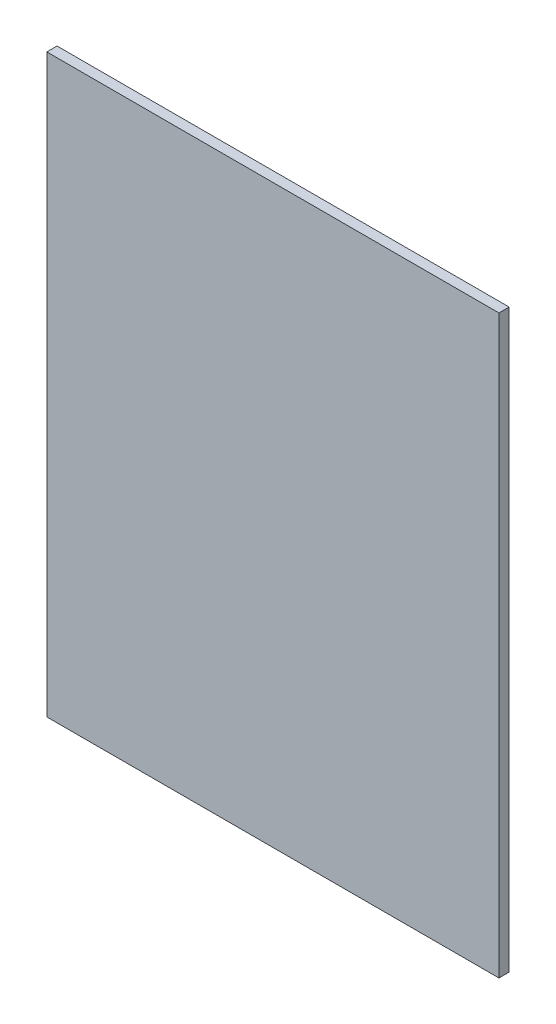
ISO-10303-21;
HEADER;
FILE_DESCRIPTION(('STEP AP214'),'2;1');
FILE_NAME('part.step','',(''),(''),'','','');
FILE_SCHEMA(('AUTOMOTIVE_DESIGN { 1 0 10303 214 1 1 1 1 }'));
ENDSEC;
DATA;
#1=APPLICATION_CONTEXT('core data for automotive mechanical design processes');
#2=APPLICATION_PROTOCOL_DEFINITION('international standard','automotive_design',2000,#1);
#3=PRODUCT_CONTEXT('',#1,'mechanical');
#4=PRODUCT('Part','Part','',(#3));
#5=PRODUCT_RELATED_PRODUCT_CATEGORY('part','',(#4));
#6=PRODUCT_DEFINITION_FORMATION('','',#4);
#7=PRODUCT_DEFINITION_CONTEXT('part definition',#1,'design');
#8=PRODUCT_DEFINITION('design','',#6,#7);
#9=PRODUCT_DEFINITION_SHAPE('','',#8);
#10=(LENGTH_UNIT() NAMED_UNIT(*) SI_UNIT(.MILLI.,.METRE.));
#11=(NAMED_UNIT(*) PLANE_ANGLE_UNIT() SI_UNIT($,.RADIAN.));
#12=(NAMED_UNIT(*) SI_UNIT($,.STERADIAN.) SOLID_ANGLE_UNIT());
#13=UNCERTAINTY_MEASURE_WITH_UNIT(LENGTH_MEASURE(1.E-05),#10,'distance_accuracy_value','');
#14=(GEOMETRIC_REPRESENTATION_CONTEXT(3) GLOBAL_UNCERTAINTY_ASSIGNED_CONTEXT((#13)) GLOBAL_UNIT_ASSIGNED_CONTEXT((#10,
#11,#12)) REPRESENTATION_CONTEXT('',''));
#15=CARTESIAN_POINT('',(0.,0.,0.));
#16=DIRECTION('',(0.,0.,1.));
#17=DIRECTION('',(1.,0.,0.));
#18=AXIS2_PLACEMENT_3D('',#15,#16,#17);
#19=CARTESIAN_POINT('',(-28.0807327001656,65.0107318574764,-1.89738));
#20=DIRECTION('',(-1.,0.,0.));
#21=DIRECTION('',(0.,-1.,0.));
#22=AXIS2_PLACEMENT_3D('',#19,#20,#21);
#23=PLANE('',#22);
#24=DIRECTION('',(0.,-1.,0.));
#25=VECTOR('',#24,1.);
#26=CARTESIAN_POINT('',(-28.0807327001656,65.0107318574764,0.));
#27=LINE('',#26,#25);
#28=CARTESIAN_POINT('',(-28.0807327001656,65.0107318574764,0.));
#29=VERTEX_POINT('',#28);
#30=CARTESIAN_POINT('',(-28.0807327001656,-41.9892681425236,0.));
#31=VERTEX_POINT('',#30);
#32=EDGE_CURVE('E99',#29,#31,#27,.T.);
#33=ORIENTED_EDGE('',*,*,#32,.F.);
#34=DIRECTION('',(0.,0.,1.));
#35=VECTOR('',#34,1.);
#36=CARTESIAN_POINT('',(-28.0807327001656,65.0107318574764,-1.89738));
#37=LINE('',#36,#35);
#38=CARTESIAN_POINT('',(-28.0807327001656,65.0107318574764,-1.89738));
#39=VERTEX_POINT('',#38);
#40=EDGE_CURVE('E11',#39,#29,#37,.T.);
#41=ORIENTED_EDGE('',*,*,#40,.F.);
#42=DIRECTION('',(0.,-1.,0.));
#43=VECTOR('',#42,1.);
#44=CARTESIAN_POINT('',(-28.0807327001656,65.0107318574764,-1.89738));
#45=LINE('',#44,#43);
#46=CARTESIAN_POINT('',(-28.0807327001656,-41.9892681425236,-1.89738));
#47=VERTEX_POINT('',#46);
#48=EDGE_CURVE('E93',#39,#47,#45,.T.);
#49=ORIENTED_EDGE('',*,*,#48,.T.);
#50=DIRECTION('',(0.,0.,1.));
#51=VECTOR('',#50,1.);
#52=CARTESIAN_POINT('',(-28.0807327001656,-41.9892681425236,-1.89738));
#53=LINE('',#52,#51);
#54=EDGE_CURVE('E38',#47,#31,#53,.T.);
#55=ORIENTED_EDGE('',*,*,#54,.T.);
#56=EDGE_LOOP('',(#33,#41,#49,#55));
#57=FACE_BOUND('',#56,.T.);
#58=ADVANCED_FACE('F35',(#57),#23,.T.);
#59=CARTESIAN_POINT('',(-28.0807327001656,65.0107318574764,-1.89738));
#60=DIRECTION('',(0.,1.,0.));
#61=DIRECTION('',(0.,0.,1.));
#62=AXIS2_PLACEMENT_3D('',#59,#60,#61);
#63=PLANE('',#62);
#64=DIRECTION('',(-1.,0.,0.));
#65=VECTOR('',#64,1.);
#66=CARTESIAN_POINT('',(-28.0807327001656,65.0107318574764,0.));
#67=LINE('',#66,#65);
#68=CARTESIAN_POINT('',(55.9192672998344,65.0107318574764,0.));
#69=VERTEX_POINT('',#68);
#70=EDGE_CURVE('E95',#69,#29,#67,.T.);
#71=ORIENTED_EDGE('',*,*,#70,.F.);
#72=DIRECTION('',(0.,0.,1.));
#73=VECTOR('',#72,1.);
#74=CARTESIAN_POINT('',(55.9192672998344,65.0107318574764,-1.89738));
#75=LINE('',#74,#73);
#76=CARTESIAN_POINT('',(55.9192672998344,65.0107318574764,-1.89738));
#77=VERTEX_POINT('',#76);
#78=EDGE_CURVE('E44',#77,#69,#75,.T.);
#79=ORIENTED_EDGE('',*,*,#78,.F.);
#80=DIRECTION('',(-1.,0.,0.));
#81=VECTOR('',#80,1.);
#82=CARTESIAN_POINT('',(-28.0807327001656,65.0107318574764,-1.89738));
#83=LINE('',#82,#81);
#84=EDGE_CURVE('E90',#77,#39,#83,.T.);
#85=ORIENTED_EDGE('',*,*,#84,.T.);
#86=ORIENTED_EDGE('',*,*,#40,.T.);
#87=EDGE_LOOP('',(#71,#79,#85,#86));
#88=FACE_BOUND('',#87,.T.);
#89=ADVANCED_FACE('F109',(#88),#63,.T.);
#90=CARTESIAN_POINT('',(55.9192672998344,65.0107318574764,-1.89738));
#91=DIRECTION('',(1.,0.,0.));
#92=DIRECTION('',(0.,1.,0.));
#93=AXIS2_PLACEMENT_3D('',#90,#91,#92);
#94=PLANE('',#93);
#95=DIRECTION('',(0.,1.,0.));
#96=VECTOR('',#95,1.);
#97=CARTESIAN_POINT('',(55.9192672998344,65.0107318574764,0.));
#98=LINE('',#97,#96);
#99=CARTESIAN_POINT('',(55.9192672998344,-41.9892681425236,0.));
#100=VERTEX_POINT('',#99);
#101=EDGE_CURVE('E85',#100,#69,#98,.T.);
#102=ORIENTED_EDGE('',*,*,#101,.F.);
#103=DIRECTION('',(0.,0.,1.));
#104=VECTOR('',#103,1.);
#105=CARTESIAN_POINT('',(55.9192672998344,-41.9892681425236,-1.89738));
#106=LINE('',#105,#104);
#107=CARTESIAN_POINT('',(55.9192672998344,-41.9892681425236,-1.89738));
#108=VERTEX_POINT('',#107);
#109=EDGE_CURVE('E80',#108,#100,#106,.T.);
#110=ORIENTED_EDGE('',*,*,#109,.F.);
#111=DIRECTION('',(0.,1.,0.));
#112=VECTOR('',#111,1.);
#113=CARTESIAN_POINT('',(55.9192672998344,65.0107318574764,-1.89738));
#114=LINE('',#113,#112);
#115=EDGE_CURVE('E83',#108,#77,#114,.T.);
#116=ORIENTED_EDGE('',*,*,#115,.T.);
#117=ORIENTED_EDGE('',*,*,#78,.T.);
#118=EDGE_LOOP('',(#102,#110,#116,#117));
#119=FACE_BOUND('',#118,.T.);
#120=ADVANCED_FACE('F82',(#119),#94,.T.);
#121=CARTESIAN_POINT('',(-28.0807327001656,-41.9892681425236,-1.89738));
#122=DIRECTION('',(0.,-1.,0.));
#123=DIRECTION('',(0.,0.,-1.));
#124=AXIS2_PLACEMENT_3D('',#121,#122,#123);
#125=PLANE('',#124);
#126=DIRECTION('',(1.,0.,0.));
#127=VECTOR('',#126,1.);
#128=CARTESIAN_POINT('',(-28.0807327001656,-41.9892681425236,0.));
#129=LINE('',#128,#127);
#130=EDGE_CURVE('E102',#31,#100,#129,.T.);
#131=ORIENTED_EDGE('',*,*,#130,.F.);
#132=ORIENTED_EDGE('',*,*,#54,.F.);
#133=DIRECTION('',(1.,0.,0.));
#134=VECTOR('',#133,1.);
#135=CARTESIAN_POINT('',(-28.0807327001656,-41.9892681425236,-1.89738));
#136=LINE('',#135,#134);
#137=EDGE_CURVE('E89',#47,#108,#136,.T.);
#138=ORIENTED_EDGE('',*,*,#137,.T.);
#139=ORIENTED_EDGE('',*,*,#109,.T.);
#140=EDGE_LOOP('',(#131,#132,#138,#139));
#141=FACE_BOUND('',#140,.T.);
#142=ADVANCED_FACE('F92',(#141),#125,.T.);
#143=CARTESIAN_POINT('',(0.,0.,-1.89738));
#144=DIRECTION('',(0.,0.,1.));
#145=DIRECTION('',(1.,0.,0.));
#146=AXIS2_PLACEMENT_3D('',#143,#144,#145);
#147=PLANE('',#146);
#148=ORIENTED_EDGE('',*,*,#48,.F.);
#149=ORIENTED_EDGE('',*,*,#84,.F.);
#150=ORIENTED_EDGE('',*,*,#115,.F.);
#151=ORIENTED_EDGE('',*,*,#137,.F.);
#152=EDGE_LOOP('',(#148,#149,#150,#151));
#153=FACE_BOUND('',#152,.T.);
#154=ADVANCED_FACE('F88',(#153),#147,.F.);
#155=CARTESIAN_POINT('',(0.,0.,0.));
#156=DIRECTION('',(0.,0.,1.));
#157=DIRECTION('',(1.,0.,0.));
#158=AXIS2_PLACEMENT_3D('',#155,#156,#157);
#159=PLANE('',#158);
#160=ORIENTED_EDGE('',*,*,#32,.T.);
#161=ORIENTED_EDGE('',*,*,#130,.T.);
#162=ORIENTED_EDGE('',*,*,#101,.T.);
#163=ORIENTED_EDGE('',*,*,#70,.T.);
#164=EDGE_LOOP('',(#160,#161,#162,#163));
#165=FACE_BOUND('',#164,.T.);
#166=ADVANCED_FACE('F108',(#165),#159,.T.);
#167=CLOSED_SHELL('',(#58,#89,#120,#142,#154,#166));
#168=MANIFOLD_SOLID_BREP('B2',#167);
#169=ADVANCED_BREP_SHAPE_REPRESENTATION('',(#18,#168),#14);
#170=SHAPE_DEFINITION_REPRESENTATION(#9,#169);
ENDSEC;
END-ISO-10303-21;
